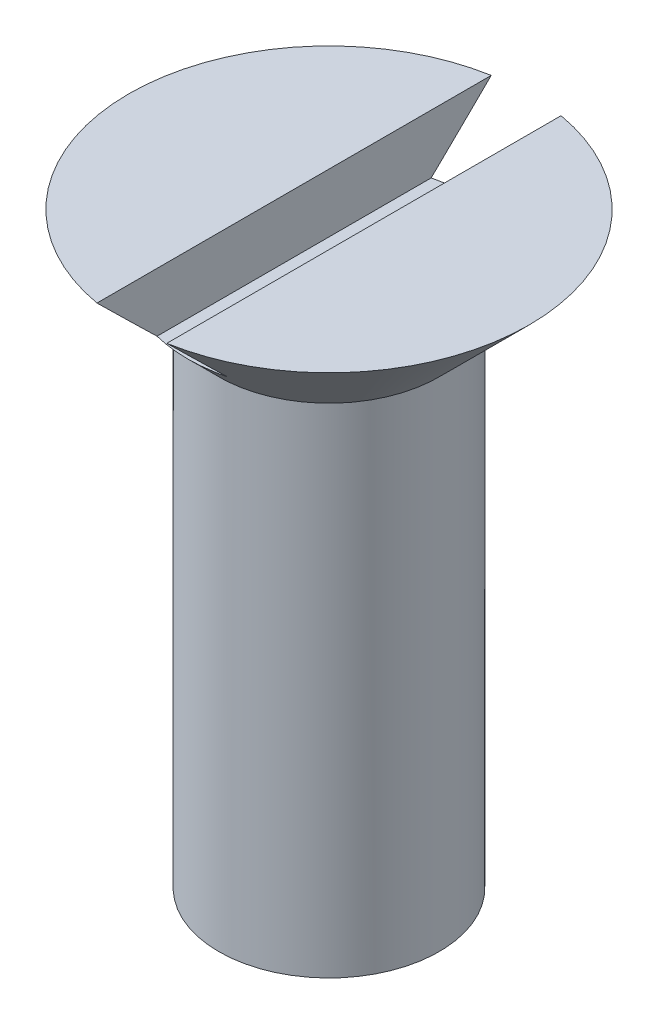
ISO-10303-21;
HEADER;
FILE_DESCRIPTION(('STEP AP214'),'2;1');
FILE_NAME('part.step','',(''),(''),'','','');
FILE_SCHEMA(('AUTOMOTIVE_DESIGN { 1 0 10303 214 1 1 1 1 }'));
ENDSEC;
DATA;
#1=APPLICATION_CONTEXT('core data for automotive mechanical design processes');
#2=APPLICATION_PROTOCOL_DEFINITION('international standard','automotive_design',2000,#1);
#3=PRODUCT_CONTEXT('',#1,'mechanical');
#4=PRODUCT('Part','Part','',(#3));
#5=PRODUCT_RELATED_PRODUCT_CATEGORY('part','',(#4));
#6=PRODUCT_DEFINITION_FORMATION('','',#4);
#7=PRODUCT_DEFINITION_CONTEXT('part definition',#1,'design');
#8=PRODUCT_DEFINITION('design','',#6,#7);
#9=PRODUCT_DEFINITION_SHAPE('','',#8);
#10=(LENGTH_UNIT() NAMED_UNIT(*) SI_UNIT(.MILLI.,.METRE.));
#11=(NAMED_UNIT(*) PLANE_ANGLE_UNIT() SI_UNIT($,.RADIAN.));
#12=(NAMED_UNIT(*) SI_UNIT($,.STERADIAN.) SOLID_ANGLE_UNIT());
#13=UNCERTAINTY_MEASURE_WITH_UNIT(LENGTH_MEASURE(1.E-05),#10,'distance_accuracy_value','');
#14=(GEOMETRIC_REPRESENTATION_CONTEXT(3) GLOBAL_UNCERTAINTY_ASSIGNED_CONTEXT((#13)) GLOBAL_UNIT_ASSIGNED_CONTEXT((#10,
#11,#12)) REPRESENTATION_CONTEXT('',''));
#15=CARTESIAN_POINT('',(0.,0.,0.));
#16=DIRECTION('',(0.,0.,1.));
#17=DIRECTION('',(1.,0.,0.));
#18=AXIS2_PLACEMENT_3D('',#15,#16,#17);
#19=CARTESIAN_POINT('',(0.,17.7320508075689,0.));
#20=DIRECTION('',(0.,1.,0.));
#21=DIRECTION('',(0.,0.,1.));
#22=AXIS2_PLACEMENT_3D('',#19,#20,#21);
#23=PLANE('',#22);
#24=DIRECTION('',(0.,0.,1.));
#25=VECTOR('',#24,1.);
#26=CARTESIAN_POINT('',(-0.95,17.7320508075689,0.));
#27=LINE('',#26,#25);
#28=CARTESIAN_POINT('',(-0.95,17.7320508075689,-5.3665631459995));
#29=VERTEX_POINT('',#28);
#30=CARTESIAN_POINT('',(-0.95,17.7320508075689,5.3665631459995));
#31=VERTEX_POINT('',#30);
#32=EDGE_CURVE('E82',#29,#31,#27,.T.);
#33=ORIENTED_EDGE('',*,*,#32,.F.);
#34=CARTESIAN_POINT('',(0.,17.7320508075689,0.));
#35=DIRECTION('',(0.,-1.,0.));
#36=DIRECTION('',(0.,0.,-1.));
#37=AXIS2_PLACEMENT_3D('',#34,#35,#36);
#38=CIRCLE('',#37,5.45);
#39=EDGE_CURVE('E95',#31,#29,#38,.T.);
#40=ORIENTED_EDGE('',*,*,#39,.F.);
#41=EDGE_LOOP('',(#33,#40));
#42=FACE_BOUND('',#41,.T.);
#43=ADVANCED_FACE('F35',(#42),#23,.T.);
#44=CARTESIAN_POINT('',(0.,1.73205080756886,0.));
#45=DIRECTION('',(0.,1.,0.));
#46=DIRECTION('',(0.,0.,1.));
#47=AXIS2_PLACEMENT_3D('',#44,#45,#46);
#48=CONICAL_SURFACE('',#47,3.,1.0471975511966);
#49=CARTESIAN_POINT('',(0.,0.,0.));
#50=VERTEX_POINT('',#49);
#51=VERTEX_LOOP('',#50);
#52=FACE_BOUND('',#51,.T.);
#53=CARTESIAN_POINT('',(0.,1.73205080756886,0.));
#54=DIRECTION('',(0.,-1.,0.));
#55=DIRECTION('',(0.,0.,-1.));
#56=AXIS2_PLACEMENT_3D('',#53,#54,#55);
#57=CIRCLE('',#56,3.);
#58=CARTESIAN_POINT('',(0.,1.73205080756886,-3.));
#59=VERTEX_POINT('',#58);
#60=EDGE_CURVE('E83',#59,#59,#57,.T.);
#61=ORIENTED_EDGE('',*,*,#60,.T.);
#62=EDGE_LOOP('',(#61));
#63=FACE_BOUND('',#62,.T.);
#64=ADVANCED_FACE('F37',(#52,#63),#48,.T.);
#65=CARTESIAN_POINT('',(0.,0.,0.));
#66=DIRECTION('',(0.,-1.,0.));
#67=DIRECTION('',(0.,0.,-1.));
#68=AXIS2_PLACEMENT_3D('',#65,#66,#67);
#69=CYLINDRICAL_SURFACE('',#68,3.);
#70=ORIENTED_EDGE('',*,*,#60,.F.);
#71=EDGE_LOOP('',(#70));
#72=FACE_BOUND('',#71,.T.);
#73=CARTESIAN_POINT('',(0.,15.2820508075689,0.));
#74=DIRECTION('',(0.,-1.,0.));
#75=DIRECTION('',(0.,0.,-1.));
#76=AXIS2_PLACEMENT_3D('',#73,#74,#75);
#77=CIRCLE('',#76,3.);
#78=CARTESIAN_POINT('',(0.,15.2820508075689,-3.));
#79=VERTEX_POINT('',#78);
#80=EDGE_CURVE('E94',#79,#79,#77,.T.);
#81=ORIENTED_EDGE('',*,*,#80,.T.);
#82=EDGE_LOOP('',(#81));
#83=FACE_BOUND('',#82,.T.);
#84=ADVANCED_FACE('F124',(#72,#83),#69,.T.);
#85=CARTESIAN_POINT('',(0.,17.7320508075689,0.));
#86=DIRECTION('',(0.,1.,0.));
#87=DIRECTION('',(0.,0.,1.));
#88=AXIS2_PLACEMENT_3D('',#85,#86,#87);
#89=CONICAL_SURFACE('',#88,5.45,0.78539816339745);
#90=CARTESIAN_POINT('',(0.,16.1320508075689,0.));
#91=DIRECTION('',(0.,-1.,0.));
#92=DIRECTION('',(0.,0.,-1.));
#93=AXIS2_PLACEMENT_3D('',#90,#91,#92);
#94=CIRCLE('',#93,3.85);
#95=CARTESIAN_POINT('',(0.95,16.1320508075689,3.73095162123552));
#96=VERTEX_POINT('',#95);
#97=CARTESIAN_POINT('',(-0.95,16.1320508075689,3.73095162123552));
#98=VERTEX_POINT('',#97);
#99=EDGE_CURVE('E11',#96,#98,#94,.T.);
#100=ORIENTED_EDGE('',*,*,#99,.T.);
#101=CARTESIAN_POINT('',(-0.95,17.7327508075689,-5.36727402784691));
#102=CARTESIAN_POINT('',(-0.95,17.5886922721517,-5.22096942686693));
#103=CARTESIAN_POINT('',(-0.95,17.444717816667,-5.07458190529039));
#104=CARTESIAN_POINT('',(-0.95,17.1568609135356,-4.78142879407388));
#105=CARTESIAN_POINT('',(-0.95,17.0129787018675,-4.63466297275423));
#106=CARTESIAN_POINT('',(-0.95,16.7229592168231,-4.33821736729776));
#107=CARTESIAN_POINT('',(-0.95,16.5768274090927,-4.18853223049868));
#108=CARTESIAN_POINT('',(-0.95,16.2851467793169,-3.88888624809532));
#109=CARTESIAN_POINT('',(-0.95,16.1395975209458,-3.7389258268418));
#110=CARTESIAN_POINT('',(-0.95,15.766193962948,-3.35268732026559));
#111=CARTESIAN_POINT('',(-0.95,15.5387724862301,-3.11598875256887));
#112=CARTESIAN_POINT('',(-0.95,15.1993161636398,-2.75849636400412));
#113=CARTESIAN_POINT('',(-0.95,15.086233748065,-2.63869876965934));
#114=CARTESIAN_POINT('',(-0.95,14.8611737581749,-2.3981635782147));
#115=CARTESIAN_POINT('',(-0.95,14.7491957385827,-2.27742639827611));
#116=CARTESIAN_POINT('',(-0.95,14.52853218465,-2.03630430512404));
#117=CARTESIAN_POINT('',(-0.95,14.4198224677065,-1.9159416674153));
#118=CARTESIAN_POINT('',(-0.95,14.2586407792311,-1.73355249406455));
#119=CARTESIAN_POINT('',(-0.95,14.2051840995162,-1.67239741852465));
#120=CARTESIAN_POINT('',(-0.95,14.099165055603,-1.54931822073711));
#121=CARTESIAN_POINT('',(-0.95,14.0466026596036,-1.4873941259721));
#122=CARTESIAN_POINT('',(-0.95,13.9430614832441,-1.3629529877671));
#123=CARTESIAN_POINT('',(-0.95,13.8920742864828,-1.30044297031366));
#124=CARTESIAN_POINT('',(-0.95,13.7918276633198,-1.17405781364907));
#125=CARTESIAN_POINT('',(-0.95,13.7425679501324,-1.11018290388925));
#126=CARTESIAN_POINT('',(-0.95,13.6467350308804,-0.980693167144405));
#127=CARTESIAN_POINT('',(-0.95,13.6001552486259,-0.915083231273134));
#128=CARTESIAN_POINT('',(-0.95,13.5109914342475,-0.781218199399245));
#129=CARTESIAN_POINT('',(-0.95,13.468403216848,-0.712965982498632));
#130=CARTESIAN_POINT('',(-0.95,13.4203966295173,-0.627290830226416));
#131=CARTESIAN_POINT('',(-0.95,13.4118340282278,-0.611626968875227));
#132=CARTESIAN_POINT('',(-0.95,13.3950800386999,-0.580097704625356));
#133=CARTESIAN_POINT('',(-0.95,13.3868887334949,-0.564232257651581));
#134=CARTESIAN_POINT('',(-0.95,13.3629403370542,-0.516321345769381));
#135=CARTESIAN_POINT('',(-0.95,13.3478072513411,-0.483958640203372));
#136=CARTESIAN_POINT('',(-0.95,13.3197969259773,-0.41866150676449));
#137=CARTESIAN_POINT('',(-0.949999999999999,13.3068978648198,-0.385736523552152));
#138=CARTESIAN_POINT('',(-0.949999999999999,13.2836823191761,-0.318972916981166));
#139=CARTESIAN_POINT('',(-0.949999999999999,13.273365703705,-0.285134340057589));
#140=CARTESIAN_POINT('',(-0.949999999999999,13.2576506612621,-0.223588326667044));
#141=CARTESIAN_POINT('',(-0.949999999999999,13.2516792467842,-0.196027953954503));
#142=CARTESIAN_POINT('',(-0.949999999999999,13.2419977769264,-0.140515145544474));
#143=CARTESIAN_POINT('',(-0.949999999999999,13.2382870461112,-0.112562829505686));
#144=CARTESIAN_POINT('',(-0.949999999999999,13.2333197960642,-0.0564821272998584));
#145=CARTESIAN_POINT('',(-0.949999999999999,13.2320592916309,-0.0283541018134179));
#146=CARTESIAN_POINT('',(-0.949999999999999,13.2320423759,0.0279054650456731));
#147=CARTESIAN_POINT('',(-0.949999999999999,13.2332867874644,0.0560370045371486));
#148=CARTESIAN_POINT('',(-0.949999999999999,13.2406963468661,0.139905474855363));
#149=CARTESIAN_POINT('',(-0.949999999999999,13.2505174291714,0.195353553361782));
#150=CARTESIAN_POINT('',(-0.949999999999999,13.2712392064539,0.27695185897088));
#151=CARTESIAN_POINT('',(-0.949999999999999,13.2791644088802,0.303935870798559));
#152=CARTESIAN_POINT('',(-0.949999999999999,13.2967256687551,0.357345323945111));
#153=CARTESIAN_POINT('',(-0.949999999999999,13.306361666027,0.383770784874301));
#154=CARTESIAN_POINT('',(-0.949999999999999,13.3457011628006,0.483109331771284));
#155=CARTESIAN_POINT('',(-0.95,13.3803028877265,0.55407284224868));
#156=CARTESIAN_POINT('',(-0.95,13.4561625731117,0.692377095293908));
#157=CARTESIAN_POINT('',(-0.95,13.4974376281943,0.759707925194257));
#158=CARTESIAN_POINT('',(-0.95,13.5843854179116,0.892236746835695));
#159=CARTESIAN_POINT('',(-0.95,13.6300915767687,0.957412601266874));
#160=CARTESIAN_POINT('',(-0.95,13.7005882475633,1.05366873930201));
#161=CARTESIAN_POINT('',(-0.95,13.7243949875735,1.08548396626291));
#162=CARTESIAN_POINT('',(-0.95,13.7725514884081,1.14870022001982));
#163=CARTESIAN_POINT('',(-0.95,13.7969012306486,1.18010126093269));
#164=CARTESIAN_POINT('',(-0.95,13.8773738276734,1.28237587769299));
#165=CARTESIAN_POINT('',(-0.95,13.9344183667244,1.35252327414237));
#166=CARTESIAN_POINT('',(-0.95,14.0500309270028,1.49155447486926));
#167=CARTESIAN_POINT('',(-0.95,14.1085991238415,1.56043813191844));
#168=CARTESIAN_POINT('',(-0.95,14.2268251389199,1.69730257484208));
#169=CARTESIAN_POINT('',(-0.95,14.2864833187205,1.76528304771273));
#170=CARTESIAN_POINT('',(-0.95,14.4065815335225,1.90055074738851));
#171=CARTESIAN_POINT('',(-0.95,14.4670215868321,1.96783795789379));
#172=CARTESIAN_POINT('',(-0.95,14.6493748093162,2.16909659121567));
#173=CARTESIAN_POINT('',(-0.95,14.7721580795638,2.30227879707892));
#174=CARTESIAN_POINT('',(-0.95,15.0190834272465,2.56731989942258));
#175=CARTESIAN_POINT('',(-0.95,15.1432252221139,2.69917906055083));
#176=CARTESIAN_POINT('',(-0.95,15.3918318353521,2.96141357028934));
#177=CARTESIAN_POINT('',(-0.95,15.5162923693904,3.09179298391855));
#178=CARTESIAN_POINT('',(-0.95,15.7658420326705,3.35196093172185));
#179=CARTESIAN_POINT('',(-0.95,15.8909311942098,3.48174943486958));
#180=CARTESIAN_POINT('',(-0.95,16.2667068941815,3.87032055879106));
#181=CARTESIAN_POINT('',(-0.95,16.5180518604383,4.12846624524119));
#182=CARTESIAN_POINT('',(-0.95,16.8498952872821,4.46799564927158));
#183=CARTESIAN_POINT('',(-0.95,16.9299544519795,4.54981026078796));
#184=CARTESIAN_POINT('',(-0.95,17.090169902313,4.71336230831225));
#185=CARTESIAN_POINT('',(-0.95,17.1703261977903,4.79509973468889));
#186=CARTESIAN_POINT('',(-0.95,17.3308277419138,4.95861796157255));
#187=CARTESIAN_POINT('',(-0.95,17.4111730969814,5.04039865757642));
#188=CARTESIAN_POINT('',(-0.95,17.5719199630662,5.20388671182281));
#189=CARTESIAN_POINT('',(-0.95,17.6523214667313,5.28559407729385));
#190=CARTESIAN_POINT('',(-0.95,17.7327508075689,5.36727402784691));
#191=B_SPLINE_CURVE_WITH_KNOTS('',3,(#101,#102,#103,#104,#105,#106,#107,#108,#109,#110,#111,
#112,#113,#114,#115,#116,#117,#118,#119,#120,#121,#122,#123,#124,#125,#126,#127,#128,#129,#130,
#131,#132,#133,#134,#135,#136,#137,#138,#139,#140,#141,#142,#143,#144,#145,#146,#147,#148,#149,
#150,#151,#152,#153,#154,#155,#156,#157,#158,#159,#160,#161,#162,#163,#164,#165,#166,#167,#168,
#169,#170,#171,#172,#173,#174,#175,#176,#177,#178,#179,#180,#181,#182,#183,#184,#185,#186,#187,
#188,#189,#190),.UNSPECIFIED.,.F.,.F.,(4,2,2,2,2,2,2,2,2,2,2,2,2,2,2,2,2,2,2,2,2,2,2,2,2,2,2,2,
2,2,2,2,2,2,2,2,2,2,2,2,2,2,2,2,4),(0.,0.615971733476574,1.2325594323941,1.86012628446734,
2.48706670861851,3.47179557281982,3.96600953924983,4.46001535278197,4.94655187034502,
5.19022198069895,5.43388340786629,5.67586585560887,5.91780793896073,6.15912850734741,
6.40019314480149,6.45374310913535,6.5073049904166,6.61441955613179,6.72042026818554,
6.82641560266438,6.91093252340631,6.99542418022093,7.07977829915206,7.16416013283656,
7.33221931503603,7.41655133425568,7.50088038770462,7.73701700389003,7.97376838906796,
8.21246995736469,8.33167593620556,8.4508778415528,8.72208373607504,8.99332102854842,
9.26464998888803,9.53598531416917,10.0793982088182,10.6227001465022,11.1634398873136,
11.7042077001596,12.7850905081259,13.1284969121907,13.4719416386943,13.8158763771415,
14.1597723411594),.UNSPECIFIED.);
#192=EDGE_CURVE('E102',#98,#31,#191,.T.);
#193=ORIENTED_EDGE('',*,*,#192,.T.);
#194=ORIENTED_EDGE('',*,*,#39,.T.);
#195=CARTESIAN_POINT('',(-0.95,16.1320508075689,-3.73095162123552));
#196=VERTEX_POINT('',#195);
#197=EDGE_CURVE('E100',#29,#196,#191,.T.);
#198=ORIENTED_EDGE('',*,*,#197,.T.);
#199=CARTESIAN_POINT('',(0.95,16.1320508075689,-3.73095162123552));
#200=VERTEX_POINT('',#199);
#201=EDGE_CURVE('E39',#196,#200,#94,.T.);
#202=ORIENTED_EDGE('',*,*,#201,.T.);
#203=CARTESIAN_POINT('',(0.95,17.7327508075689,5.36727402784691));
#204=CARTESIAN_POINT('',(0.95,17.5886922721517,5.22096942686693));
#205=CARTESIAN_POINT('',(0.95,17.444717816667,5.0745819052904));
#206=CARTESIAN_POINT('',(0.95,17.1568609135356,4.78142879407388));
#207=CARTESIAN_POINT('',(0.95,17.0129787018675,4.63466297275423));
#208=CARTESIAN_POINT('',(0.95,16.7229592168231,4.33821736729777));
#209=CARTESIAN_POINT('',(0.95,16.5768274090927,4.18853223049868));
#210=CARTESIAN_POINT('',(0.95,16.2851467793169,3.88888624809533));
#211=CARTESIAN_POINT('',(0.95,16.1395975209458,3.73892582684181));
#212=CARTESIAN_POINT('',(0.95,15.766193962948,3.3526873202656));
#213=CARTESIAN_POINT('',(0.95,15.5387724862301,3.11598875256888));
#214=CARTESIAN_POINT('',(0.95,15.1993161636398,2.75849636400413));
#215=CARTESIAN_POINT('',(0.95,15.086233748065,2.63869876965935));
#216=CARTESIAN_POINT('',(0.95,14.8611737581749,2.39816357821471));
#217=CARTESIAN_POINT('',(0.95,14.7491957385827,2.27742639827611));
#218=CARTESIAN_POINT('',(0.95,14.52853218465,2.03630430512405));
#219=CARTESIAN_POINT('',(0.95,14.4198224677066,1.9159416674153));
#220=CARTESIAN_POINT('',(0.95,14.2586407792311,1.73355249406455));
#221=CARTESIAN_POINT('',(0.95,14.2051840995162,1.67239741852466));
#222=CARTESIAN_POINT('',(0.95,14.099165055603,1.54931822073711));
#223=CARTESIAN_POINT('',(0.950000000000001,14.0466026596036,1.48739412597211));
#224=CARTESIAN_POINT('',(0.950000000000001,13.9430614832441,1.3629529877671));
#225=CARTESIAN_POINT('',(0.950000000000001,13.8920742864828,1.30044297031366));
#226=CARTESIAN_POINT('',(0.950000000000001,13.7918276633198,1.17405781364908));
#227=CARTESIAN_POINT('',(0.950000000000001,13.7425679501324,1.11018290388925));
#228=CARTESIAN_POINT('',(0.950000000000001,13.6467350308804,0.980693167144408));
#229=CARTESIAN_POINT('',(0.950000000000001,13.6001552486259,0.915083231273136));
#230=CARTESIAN_POINT('',(0.950000000000001,13.5109914342475,0.781218199399246));
#231=CARTESIAN_POINT('',(0.950000000000001,13.468403216848,0.712965982498633));
#232=CARTESIAN_POINT('',(0.950000000000001,13.4203966295173,0.627290830226417));
#233=CARTESIAN_POINT('',(0.950000000000001,13.4118340282278,0.611626968875228));
#234=CARTESIAN_POINT('',(0.950000000000001,13.3950800386999,0.580097704625358));
#235=CARTESIAN_POINT('',(0.950000000000001,13.3868887334949,0.564232257651583));
#236=CARTESIAN_POINT('',(0.950000000000001,13.3629403370542,0.516321345769382));
#237=CARTESIAN_POINT('',(0.950000000000001,13.3478072513411,0.483958640203373));
#238=CARTESIAN_POINT('',(0.950000000000001,13.3197969259773,0.41866150676449));
#239=CARTESIAN_POINT('',(0.950000000000001,13.3068978648199,0.385736523552153));
#240=CARTESIAN_POINT('',(0.950000000000001,13.2836823191761,0.318972916981167));
#241=CARTESIAN_POINT('',(0.950000000000001,13.273365703705,0.285134340057589));
#242=CARTESIAN_POINT('',(0.950000000000001,13.2576506612621,0.223588326667045));
#243=CARTESIAN_POINT('',(0.950000000000001,13.2516792467842,0.196027953954504));
#244=CARTESIAN_POINT('',(0.950000000000001,13.2419977769264,0.140515145544475));
#245=CARTESIAN_POINT('',(0.950000000000001,13.2382870461112,0.112562829505687));
#246=CARTESIAN_POINT('',(0.950000000000001,13.2333197960642,0.0564821272998593));
#247=CARTESIAN_POINT('',(0.950000000000001,13.2320592916309,0.0283541018134189));
#248=CARTESIAN_POINT('',(0.950000000000001,13.2320423759,-0.0279054650456725));
#249=CARTESIAN_POINT('',(0.950000000000001,13.2332867874644,-0.0560370045371483));
#250=CARTESIAN_POINT('',(0.950000000000001,13.2406963468661,-0.139905474855363));
#251=CARTESIAN_POINT('',(0.950000000000001,13.2505174291714,-0.195353553361782));
#252=CARTESIAN_POINT('',(0.950000000000001,13.2712392064539,-0.276951858970881));
#253=CARTESIAN_POINT('',(0.950000000000001,13.2791644088802,-0.303935870798561));
#254=CARTESIAN_POINT('',(0.950000000000001,13.2967256687551,-0.357345323945113));
#255=CARTESIAN_POINT('',(0.950000000000001,13.306361666027,-0.383770784874302));
#256=CARTESIAN_POINT('',(0.950000000000001,13.3457011628006,-0.483109331771284));
#257=CARTESIAN_POINT('',(0.950000000000001,13.3803028877265,-0.55407284224868));
#258=CARTESIAN_POINT('',(0.950000000000001,13.4561625731117,-0.692377095293909));
#259=CARTESIAN_POINT('',(0.950000000000001,13.4974376281943,-0.759707925194259));
#260=CARTESIAN_POINT('',(0.950000000000001,13.5843854179116,-0.892236746835697));
#261=CARTESIAN_POINT('',(0.950000000000001,13.6300915767687,-0.957412601266876));
#262=CARTESIAN_POINT('',(0.950000000000001,13.7005882475633,-1.05366873930201));
#263=CARTESIAN_POINT('',(0.950000000000001,13.7243949875735,-1.08548396626291));
#264=CARTESIAN_POINT('',(0.950000000000001,13.7725514884081,-1.14870022001982));
#265=CARTESIAN_POINT('',(0.950000000000001,13.7969012306486,-1.18010126093269));
#266=CARTESIAN_POINT('',(0.950000000000001,13.8773738276734,-1.28237587769299));
#267=CARTESIAN_POINT('',(0.950000000000001,13.9344183667245,-1.35252327414238));
#268=CARTESIAN_POINT('',(0.950000000000001,14.0500309270028,-1.49155447486927));
#269=CARTESIAN_POINT('',(0.95,14.1085991238415,-1.56043813191844));
#270=CARTESIAN_POINT('',(0.95,14.2268251389199,-1.69730257484208));
#271=CARTESIAN_POINT('',(0.95,14.2864833187205,-1.76528304771273));
#272=CARTESIAN_POINT('',(0.95,14.4065815335225,-1.90055074738851));
#273=CARTESIAN_POINT('',(0.95,14.4670215868321,-1.96783795789379));
#274=CARTESIAN_POINT('',(0.95,14.6493748093162,-2.16909659121567));
#275=CARTESIAN_POINT('',(0.95,14.7721580795639,-2.30227879707892));
#276=CARTESIAN_POINT('',(0.95,15.0190834272465,-2.56731989942258));
#277=CARTESIAN_POINT('',(0.95,15.1432252221139,-2.69917906055083));
#278=CARTESIAN_POINT('',(0.95,15.3918318353521,-2.96141357028935));
#279=CARTESIAN_POINT('',(0.95,15.5162923693904,-3.09179298391856));
#280=CARTESIAN_POINT('',(0.95,15.7658420326705,-3.35196093172186));
#281=CARTESIAN_POINT('',(0.95,15.8909311942098,-3.48174943486959));
#282=CARTESIAN_POINT('',(0.95,16.2667068941815,-3.87032055879107));
#283=CARTESIAN_POINT('',(0.95,16.5180518604384,-4.12846624524119));
#284=CARTESIAN_POINT('',(0.95,16.8498952872821,-4.46799564927159));
#285=CARTESIAN_POINT('',(0.95,16.9299544519795,-4.54981026078797));
#286=CARTESIAN_POINT('',(0.95,17.090169902313,-4.71336230831226));
#287=CARTESIAN_POINT('',(0.95,17.1703261977903,-4.7950997346889));
#288=CARTESIAN_POINT('',(0.95,17.3308277419138,-4.95861796157255));
#289=CARTESIAN_POINT('',(0.95,17.4111730969814,-5.04039865757643));
#290=CARTESIAN_POINT('',(0.95,17.5719199630662,-5.20388671182282));
#291=CARTESIAN_POINT('',(0.95,17.6523214667313,-5.28559407729385));
#292=CARTESIAN_POINT('',(0.95,17.7327508075689,-5.36727402784691));
#293=B_SPLINE_CURVE_WITH_KNOTS('',3,(#203,#204,#205,#206,#207,#208,#209,#210,#211,#212,#213,
#214,#215,#216,#217,#218,#219,#220,#221,#222,#223,#224,#225,#226,#227,#228,#229,#230,#231,#232,
#233,#234,#235,#236,#237,#238,#239,#240,#241,#242,#243,#244,#245,#246,#247,#248,#249,#250,#251,
#252,#253,#254,#255,#256,#257,#258,#259,#260,#261,#262,#263,#264,#265,#266,#267,#268,#269,#270,
#271,#272,#273,#274,#275,#276,#277,#278,#279,#280,#281,#282,#283,#284,#285,#286,#287,#288,#289,
#290,#291,#292),.UNSPECIFIED.,.F.,.F.,(4,2,2,2,2,2,2,2,2,2,2,2,2,2,2,2,2,2,2,2,2,2,2,2,2,2,2,2,
2,2,2,2,2,2,2,2,2,2,2,2,2,2,2,2,4),(0.,0.615971733476573,1.23255943239409,1.86012628446733,
2.4870667086185,3.47179557281981,3.96600953924982,4.46001535278197,4.94655187034501,
5.19022198069894,5.43388340786629,5.67586585560887,5.91780793896073,6.1591285073474,
6.40019314480148,6.45374310913535,6.5073049904166,6.61441955613179,6.72042026818554,
6.82641560266437,6.91093252340631,6.99542418022093,7.07977829915206,7.16416013283656,
7.33221931503603,7.41655133425568,7.50088038770462,7.73701700389003,7.97376838906797,
8.21246995736469,8.33167593620557,8.4508778415528,8.72208373607505,8.99332102854842,
9.26464998888803,9.53598531416918,10.0793982088182,10.6227001465022,11.1634398873137,
11.7042077001596,12.7850905081259,13.1284969121907,13.4719416386944,13.8158763771415,
14.1597723411594),.UNSPECIFIED.);
#294=CARTESIAN_POINT('',(0.95,17.7320508075689,-5.3665631459995));
#295=VERTEX_POINT('',#294);
#296=EDGE_CURVE('E77',#200,#295,#293,.T.);
#297=ORIENTED_EDGE('',*,*,#296,.T.);
#298=CARTESIAN_POINT('',(0.95,17.7320508075689,5.3665631459995));
#299=VERTEX_POINT('',#298);
#300=EDGE_CURVE('E89',#295,#299,#38,.T.);
#301=ORIENTED_EDGE('',*,*,#300,.T.);
#302=EDGE_CURVE('E50',#299,#96,#293,.T.);
#303=ORIENTED_EDGE('',*,*,#302,.T.);
#304=EDGE_LOOP('',(#100,#193,#194,#198,#202,#297,#301,#303));
#305=FACE_BOUND('',#304,.T.);
#306=ORIENTED_EDGE('',*,*,#80,.F.);
#307=EDGE_LOOP('',(#306));
#308=FACE_BOUND('',#307,.T.);
#309=ADVANCED_FACE('F87',(#305,#308),#89,.T.);
#310=DIRECTION('',(0.,0.,-1.));
#311=VECTOR('',#310,1.);
#312=CARTESIAN_POINT('',(0.95,17.7320508075689,0.));
#313=LINE('',#312,#311);
#314=EDGE_CURVE('E74',#299,#295,#313,.T.);
#315=ORIENTED_EDGE('',*,*,#314,.F.);
#316=ORIENTED_EDGE('',*,*,#300,.F.);
#317=EDGE_LOOP('',(#315,#316));
#318=FACE_BOUND('',#317,.T.);
#319=ADVANCED_FACE('F93',(#318),#23,.T.);
#320=CARTESIAN_POINT('',(-0.95,16.1320508075689,-5.45));
#321=DIRECTION('',(0.,-1.,0.));
#322=DIRECTION('',(0.,0.,-1.));
#323=AXIS2_PLACEMENT_3D('',#320,#321,#322);
#324=PLANE('',#323);
#325=DIRECTION('',(0.,0.,1.));
#326=VECTOR('',#325,1.);
#327=CARTESIAN_POINT('',(0.95,16.1320508075689,-5.45));
#328=LINE('',#327,#326);
#329=EDGE_CURVE('E91',#200,#96,#328,.T.);
#330=ORIENTED_EDGE('',*,*,#329,.F.);
#331=ORIENTED_EDGE('',*,*,#201,.F.);
#332=DIRECTION('',(0.,0.,1.));
#333=VECTOR('',#332,1.);
#334=CARTESIAN_POINT('',(-0.95,16.1320508075689,-5.45));
#335=LINE('',#334,#333);
#336=EDGE_CURVE('E145',#196,#98,#335,.T.);
#337=ORIENTED_EDGE('',*,*,#336,.T.);
#338=ORIENTED_EDGE('',*,*,#99,.F.);
#339=EDGE_LOOP('',(#330,#331,#337,#338));
#340=FACE_BOUND('',#339,.T.);
#341=ADVANCED_FACE('F126',(#340),#324,.F.);
#342=CARTESIAN_POINT('',(-0.95,17.7320508075689,-5.45));
#343=DIRECTION('',(-1.,0.,0.));
#344=DIRECTION('',(0.,-1.,0.));
#345=AXIS2_PLACEMENT_3D('',#342,#343,#344);
#346=PLANE('',#345);
#347=ORIENTED_EDGE('',*,*,#32,.T.);
#348=ORIENTED_EDGE('',*,*,#192,.F.);
#349=ORIENTED_EDGE('',*,*,#336,.F.);
#350=ORIENTED_EDGE('',*,*,#197,.F.);
#351=EDGE_LOOP('',(#347,#348,#349,#350));
#352=FACE_BOUND('',#351,.T.);
#353=ADVANCED_FACE('F114',(#352),#346,.F.);
#354=CARTESIAN_POINT('',(0.95,17.7320508075689,-5.45));
#355=DIRECTION('',(1.,0.,0.));
#356=DIRECTION('',(0.,1.,0.));
#357=AXIS2_PLACEMENT_3D('',#354,#355,#356);
#358=PLANE('',#357);
#359=ORIENTED_EDGE('',*,*,#314,.T.);
#360=ORIENTED_EDGE('',*,*,#296,.F.);
#361=ORIENTED_EDGE('',*,*,#329,.T.);
#362=ORIENTED_EDGE('',*,*,#302,.F.);
#363=EDGE_LOOP('',(#359,#360,#361,#362));
#364=FACE_BOUND('',#363,.T.);
#365=ADVANCED_FACE('F76',(#364),#358,.F.);
#366=CLOSED_SHELL('',(#43,#64,#84,#309,#319,#341,#353,#365));
#367=MANIFOLD_SOLID_BREP('B2',#366);
#368=ADVANCED_BREP_SHAPE_REPRESENTATION('',(#18,#367),#14);
#369=SHAPE_DEFINITION_REPRESENTATION(#9,#368);
ENDSEC;
END-ISO-10303-21;
